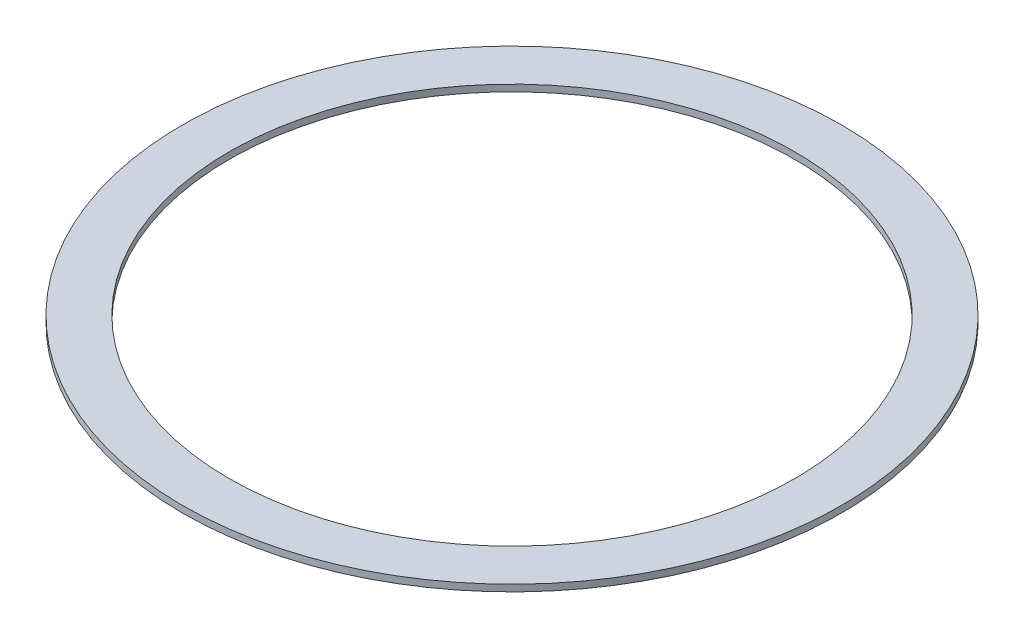
ISO-10303-21;
HEADER;
FILE_DESCRIPTION(('STEP AP214'),'2;1');
FILE_NAME('part.step','',(''),(''),'','','');
FILE_SCHEMA(('AUTOMOTIVE_DESIGN { 1 0 10303 214 1 1 1 1 }'));
ENDSEC;
DATA;
#1=APPLICATION_CONTEXT('core data for automotive mechanical design processes');
#2=APPLICATION_PROTOCOL_DEFINITION('international standard','automotive_design',2000,#1);
#3=PRODUCT_CONTEXT('',#1,'mechanical');
#4=PRODUCT('Part','Part','',(#3));
#5=PRODUCT_RELATED_PRODUCT_CATEGORY('part','',(#4));
#6=PRODUCT_DEFINITION_FORMATION('','',#4);
#7=PRODUCT_DEFINITION_CONTEXT('part definition',#1,'design');
#8=PRODUCT_DEFINITION('design','',#6,#7);
#9=PRODUCT_DEFINITION_SHAPE('','',#8);
#10=(LENGTH_UNIT() NAMED_UNIT(*) SI_UNIT(.MILLI.,.METRE.));
#11=(NAMED_UNIT(*) PLANE_ANGLE_UNIT() SI_UNIT($,.RADIAN.));
#12=(NAMED_UNIT(*) SI_UNIT($,.STERADIAN.) SOLID_ANGLE_UNIT());
#13=UNCERTAINTY_MEASURE_WITH_UNIT(LENGTH_MEASURE(1.E-05),#10,'distance_accuracy_value','');
#14=(GEOMETRIC_REPRESENTATION_CONTEXT(3) GLOBAL_UNCERTAINTY_ASSIGNED_CONTEXT((#13)) GLOBAL_UNIT_ASSIGNED_CONTEXT((#10,
#11,#12)) REPRESENTATION_CONTEXT('',''));
#15=CARTESIAN_POINT('',(0.,0.,0.));
#16=DIRECTION('',(0.,0.,1.));
#17=DIRECTION('',(1.,0.,0.));
#18=AXIS2_PLACEMENT_3D('',#15,#16,#17);
#19=CARTESIAN_POINT('',(0.,2.,0.));
#20=DIRECTION('',(0.,1.,0.));
#21=DIRECTION('',(0.,0.,1.));
#22=AXIS2_PLACEMENT_3D('',#19,#20,#21);
#23=PLANE('',#22);
#24=CARTESIAN_POINT('',(0.,2.,0.));
#25=DIRECTION('',(0.,1.,0.));
#26=DIRECTION('',(0.,0.,1.));
#27=AXIS2_PLACEMENT_3D('',#24,#25,#26);
#28=CIRCLE('',#27,99.);
#29=CARTESIAN_POINT('',(0.,2.,99.));
#30=VERTEX_POINT('',#29);
#31=EDGE_CURVE('E10',#30,#30,#28,.T.);
#32=ORIENTED_EDGE('',*,*,#31,.T.);
#33=EDGE_LOOP('',(#32));
#34=FACE_BOUND('',#33,.T.);
#35=CARTESIAN_POINT('',(0.,2.,0.));
#36=DIRECTION('',(0.,1.,0.));
#37=DIRECTION('',(0.,0.,1.));
#38=AXIS2_PLACEMENT_3D('',#35,#36,#37);
#39=CIRCLE('',#38,85.);
#40=CARTESIAN_POINT('',(0.,2.,85.));
#41=VERTEX_POINT('',#40);
#42=EDGE_CURVE('E42',#41,#41,#39,.T.);
#43=ORIENTED_EDGE('',*,*,#42,.F.);
#44=EDGE_LOOP('',(#43));
#45=FACE_BOUND('',#44,.T.);
#46=ADVANCED_FACE('F31',(#34,#45),#23,.T.);
#47=CARTESIAN_POINT('',(0.,0.,0.));
#48=DIRECTION('',(0.,1.,0.));
#49=DIRECTION('',(0.,0.,1.));
#50=AXIS2_PLACEMENT_3D('',#47,#48,#49);
#51=PLANE('',#50);
#52=CARTESIAN_POINT('',(0.,0.,0.));
#53=DIRECTION('',(0.,1.,0.));
#54=DIRECTION('',(0.,0.,1.));
#55=AXIS2_PLACEMENT_3D('',#52,#53,#54);
#56=CIRCLE('',#55,99.);
#57=CARTESIAN_POINT('',(0.,0.,99.));
#58=VERTEX_POINT('',#57);
#59=EDGE_CURVE('E35',#58,#58,#56,.T.);
#60=ORIENTED_EDGE('',*,*,#59,.F.);
#61=EDGE_LOOP('',(#60));
#62=FACE_BOUND('',#61,.T.);
#63=CARTESIAN_POINT('',(0.,0.,0.));
#64=DIRECTION('',(0.,1.,0.));
#65=DIRECTION('',(0.,0.,1.));
#66=AXIS2_PLACEMENT_3D('',#63,#64,#65);
#67=CIRCLE('',#66,85.);
#68=CARTESIAN_POINT('',(0.,0.,85.));
#69=VERTEX_POINT('',#68);
#70=EDGE_CURVE('E44',#69,#69,#67,.T.);
#71=ORIENTED_EDGE('',*,*,#70,.T.);
#72=EDGE_LOOP('',(#71));
#73=FACE_BOUND('',#72,.T.);
#74=ADVANCED_FACE('F54',(#62,#73),#51,.F.);
#75=CARTESIAN_POINT('',(0.,2.,0.));
#76=DIRECTION('',(0.,-1.,0.));
#77=DIRECTION('',(0.,0.,-1.));
#78=AXIS2_PLACEMENT_3D('',#75,#76,#77);
#79=CYLINDRICAL_SURFACE('',#78,99.);
#80=ORIENTED_EDGE('',*,*,#31,.F.);
#81=EDGE_LOOP('',(#80));
#82=FACE_BOUND('',#81,.T.);
#83=ORIENTED_EDGE('',*,*,#59,.T.);
#84=EDGE_LOOP('',(#83));
#85=FACE_BOUND('',#84,.T.);
#86=ADVANCED_FACE('F33',(#82,#85),#79,.T.);
#87=CARTESIAN_POINT('',(0.,2.,0.));
#88=DIRECTION('',(0.,-1.,0.));
#89=DIRECTION('',(0.,0.,-1.));
#90=AXIS2_PLACEMENT_3D('',#87,#88,#89);
#91=CYLINDRICAL_SURFACE('',#90,85.);
#92=ORIENTED_EDGE('',*,*,#42,.T.);
#93=EDGE_LOOP('',(#92));
#94=FACE_BOUND('',#93,.T.);
#95=ORIENTED_EDGE('',*,*,#70,.F.);
#96=EDGE_LOOP('',(#95));
#97=FACE_BOUND('',#96,.T.);
#98=ADVANCED_FACE('F50',(#94,#97),#91,.F.);
#99=CLOSED_SHELL('',(#46,#74,#86,#98));
#100=MANIFOLD_SOLID_BREP('B2',#99);
#101=ADVANCED_BREP_SHAPE_REPRESENTATION('',(#18,#100),#14);
#102=SHAPE_DEFINITION_REPRESENTATION(#9,#101);
ENDSEC;
END-ISO-10303-21;
